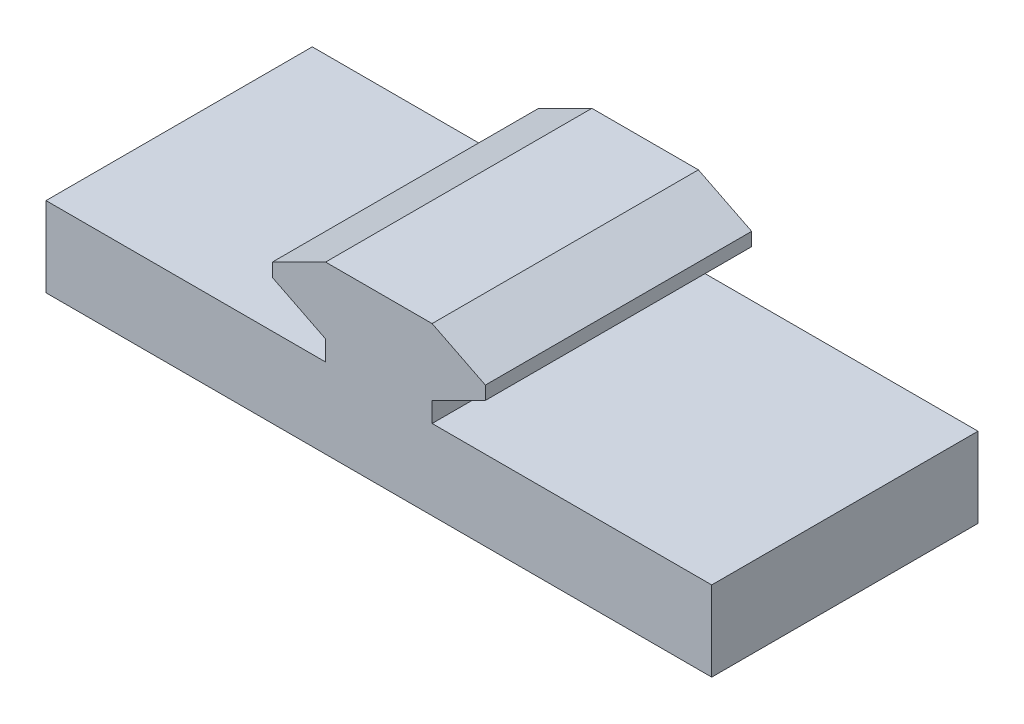
ISO-10303-21;
HEADER;
FILE_DESCRIPTION(('STEP AP214'),'2;1');
FILE_NAME('part.step','',(''),(''),'','','');
FILE_SCHEMA(('AUTOMOTIVE_DESIGN { 1 0 10303 214 1 1 1 1 }'));
ENDSEC;
DATA;
#1=APPLICATION_CONTEXT('core data for automotive mechanical design processes');
#2=APPLICATION_PROTOCOL_DEFINITION('international standard','automotive_design',2000,#1);
#3=PRODUCT_CONTEXT('',#1,'mechanical');
#4=PRODUCT('Part','Part','',(#3));
#5=PRODUCT_RELATED_PRODUCT_CATEGORY('part','',(#4));
#6=PRODUCT_DEFINITION_FORMATION('','',#4);
#7=PRODUCT_DEFINITION_CONTEXT('part definition',#1,'design');
#8=PRODUCT_DEFINITION('design','',#6,#7);
#9=PRODUCT_DEFINITION_SHAPE('','',#8);
#10=(LENGTH_UNIT() NAMED_UNIT(*) SI_UNIT(.MILLI.,.METRE.));
#11=(NAMED_UNIT(*) PLANE_ANGLE_UNIT() SI_UNIT($,.RADIAN.));
#12=(NAMED_UNIT(*) SI_UNIT($,.STERADIAN.) SOLID_ANGLE_UNIT());
#13=UNCERTAINTY_MEASURE_WITH_UNIT(LENGTH_MEASURE(1.E-05),#10,'distance_accuracy_value','');
#14=(GEOMETRIC_REPRESENTATION_CONTEXT(3) GLOBAL_UNCERTAINTY_ASSIGNED_CONTEXT((#13)) GLOBAL_UNIT_ASSIGNED_CONTEXT((#10,
#11,#12)) REPRESENTATION_CONTEXT('',''));
#15=CARTESIAN_POINT('',(0.,0.,0.));
#16=DIRECTION('',(0.,0.,1.));
#17=DIRECTION('',(1.,0.,0.));
#18=AXIS2_PLACEMENT_3D('',#15,#16,#17);
#19=CARTESIAN_POINT('',(-9.84530456711568,-8.19293028434811,20.));
#20=DIRECTION('',(1.,0.,0.));
#21=DIRECTION('',(0.,0.,-1.));
#22=AXIS2_PLACEMENT_3D('',#19,#20,#21);
#23=PLANE('',#22);
#24=DIRECTION('',(0.,-1.,0.));
#25=VECTOR('',#24,1.);
#26=CARTESIAN_POINT('',(-9.84530456711568,-8.19293028434811,0.));
#27=LINE('',#26,#25);
#28=CARTESIAN_POINT('',(-9.84530456711568,-2.19293028434811,0.));
#29=VERTEX_POINT('',#28);
#30=CARTESIAN_POINT('',(-9.84530456711568,-8.19293028434811,0.));
#31=VERTEX_POINT('',#30);
#32=EDGE_CURVE('E165',#29,#31,#27,.T.);
#33=ORIENTED_EDGE('',*,*,#32,.T.);
#34=DIRECTION('',(0.,0.,-1.));
#35=VECTOR('',#34,1.);
#36=CARTESIAN_POINT('',(-9.84530456711568,-8.19293028434811,20.));
#37=LINE('',#36,#35);
#38=CARTESIAN_POINT('',(-9.84530456711568,-8.19293028434811,20.));
#39=VERTEX_POINT('',#38);
#40=EDGE_CURVE('E11',#39,#31,#37,.T.);
#41=ORIENTED_EDGE('',*,*,#40,.F.);
#42=DIRECTION('',(0.,-1.,0.));
#43=VECTOR('',#42,1.);
#44=CARTESIAN_POINT('',(-9.84530456711568,-8.19293028434811,20.));
#45=LINE('',#44,#43);
#46=CARTESIAN_POINT('',(-9.84530456711568,-2.19293028434811,20.));
#47=VERTEX_POINT('',#46);
#48=EDGE_CURVE('E191',#47,#39,#45,.T.);
#49=ORIENTED_EDGE('',*,*,#48,.F.);
#50=DIRECTION('',(0.,0.,-1.));
#51=VECTOR('',#50,1.);
#52=CARTESIAN_POINT('',(-9.84530456711568,-2.19293028434811,20.));
#53=LINE('',#52,#51);
#54=EDGE_CURVE('E161',#47,#29,#53,.T.);
#55=ORIENTED_EDGE('',*,*,#54,.T.);
#56=EDGE_LOOP('',(#33,#41,#49,#55));
#57=FACE_BOUND('',#56,.T.);
#58=ADVANCED_FACE('F33',(#57),#23,.F.);
#59=CARTESIAN_POINT('',(-9.84530456711568,-8.19293028434811,20.));
#60=DIRECTION('',(0.,1.,0.));
#61=DIRECTION('',(0.,0.,1.));
#62=AXIS2_PLACEMENT_3D('',#59,#60,#61);
#63=PLANE('',#62);
#64=DIRECTION('',(1.,0.,0.));
#65=VECTOR('',#64,1.);
#66=CARTESIAN_POINT('',(-9.84530456711568,-8.19293028434811,0.));
#67=LINE('',#66,#65);
#68=CARTESIAN_POINT('',(40.1546954328843,-8.19293028434811,0.));
#69=VERTEX_POINT('',#68);
#70=EDGE_CURVE('E168',#31,#69,#67,.T.);
#71=ORIENTED_EDGE('',*,*,#70,.T.);
#72=DIRECTION('',(0.,0.,-1.));
#73=VECTOR('',#72,1.);
#74=CARTESIAN_POINT('',(40.1546954328843,-8.19293028434811,20.));
#75=LINE('',#74,#73);
#76=CARTESIAN_POINT('',(40.1546954328843,-8.19293028434811,20.));
#77=VERTEX_POINT('',#76);
#78=EDGE_CURVE('E41',#77,#69,#75,.T.);
#79=ORIENTED_EDGE('',*,*,#78,.F.);
#80=DIRECTION('',(1.,0.,0.));
#81=VECTOR('',#80,1.);
#82=CARTESIAN_POINT('',(-9.84530456711568,-8.19293028434811,20.));
#83=LINE('',#82,#81);
#84=EDGE_CURVE('E110',#39,#77,#83,.T.);
#85=ORIENTED_EDGE('',*,*,#84,.F.);
#86=ORIENTED_EDGE('',*,*,#40,.T.);
#87=EDGE_LOOP('',(#71,#79,#85,#86));
#88=FACE_BOUND('',#87,.T.);
#89=ADVANCED_FACE('F279',(#88),#63,.F.);
#90=CARTESIAN_POINT('',(40.1546954328843,-8.19293028434811,20.));
#91=DIRECTION('',(-1.,0.,0.));
#92=DIRECTION('',(0.,0.,1.));
#93=AXIS2_PLACEMENT_3D('',#90,#91,#92);
#94=PLANE('',#93);
#95=DIRECTION('',(0.,1.,0.));
#96=VECTOR('',#95,1.);
#97=CARTESIAN_POINT('',(40.1546954328843,-8.19293028434811,0.));
#98=LINE('',#97,#96);
#99=CARTESIAN_POINT('',(40.1546954328843,-2.19293028434811,0.));
#100=VERTEX_POINT('',#99);
#101=EDGE_CURVE('E170',#69,#100,#98,.T.);
#102=ORIENTED_EDGE('',*,*,#101,.T.);
#103=DIRECTION('',(0.,0.,-1.));
#104=VECTOR('',#103,1.);
#105=CARTESIAN_POINT('',(40.1546954328843,-2.19293028434811,20.));
#106=LINE('',#105,#104);
#107=CARTESIAN_POINT('',(40.1546954328843,-2.19293028434811,20.));
#108=VERTEX_POINT('',#107);
#109=EDGE_CURVE('E216',#108,#100,#106,.T.);
#110=ORIENTED_EDGE('',*,*,#109,.F.);
#111=DIRECTION('',(0.,1.,0.));
#112=VECTOR('',#111,1.);
#113=CARTESIAN_POINT('',(40.1546954328843,-8.19293028434811,20.));
#114=LINE('',#113,#112);
#115=EDGE_CURVE('E224',#77,#108,#114,.T.);
#116=ORIENTED_EDGE('',*,*,#115,.F.);
#117=ORIENTED_EDGE('',*,*,#78,.T.);
#118=EDGE_LOOP('',(#102,#110,#116,#117));
#119=FACE_BOUND('',#118,.T.);
#120=ADVANCED_FACE('F222',(#119),#94,.F.);
#121=CARTESIAN_POINT('',(19.1546954328843,-2.19293028434811,20.));
#122=DIRECTION('',(0.,-1.,0.));
#123=DIRECTION('',(0.,0.,-1.));
#124=AXIS2_PLACEMENT_3D('',#121,#122,#123);
#125=PLANE('',#124);
#126=DIRECTION('',(-1.,0.,0.));
#127=VECTOR('',#126,1.);
#128=CARTESIAN_POINT('',(19.1546954328843,-2.19293028434811,0.));
#129=LINE('',#128,#127);
#130=CARTESIAN_POINT('',(19.1546954328843,-2.19293028434811,0.));
#131=VERTEX_POINT('',#130);
#132=EDGE_CURVE('E172',#100,#131,#129,.T.);
#133=ORIENTED_EDGE('',*,*,#132,.T.);
#134=DIRECTION('',(0.,0.,-1.));
#135=VECTOR('',#134,1.);
#136=CARTESIAN_POINT('',(19.1546954328843,-2.19293028434811,20.));
#137=LINE('',#136,#135);
#138=CARTESIAN_POINT('',(19.1546954328843,-2.19293028434811,20.));
#139=VERTEX_POINT('',#138);
#140=EDGE_CURVE('E213',#139,#131,#137,.T.);
#141=ORIENTED_EDGE('',*,*,#140,.F.);
#142=DIRECTION('',(-1.,0.,0.));
#143=VECTOR('',#142,1.);
#144=CARTESIAN_POINT('',(19.1546954328843,-2.19293028434811,20.));
#145=LINE('',#144,#143);
#146=EDGE_CURVE('E242',#108,#139,#145,.T.);
#147=ORIENTED_EDGE('',*,*,#146,.F.);
#148=ORIENTED_EDGE('',*,*,#109,.T.);
#149=EDGE_LOOP('',(#133,#141,#147,#148));
#150=FACE_BOUND('',#149,.T.);
#151=ADVANCED_FACE('F233',(#150),#125,.F.);
#152=CARTESIAN_POINT('',(19.1546954328843,-2.19293028434811,20.));
#153=DIRECTION('',(-1.,0.,0.));
#154=DIRECTION('',(0.,0.,1.));
#155=AXIS2_PLACEMENT_3D('',#152,#153,#154);
#156=PLANE('',#155);
#157=DIRECTION('',(0.,1.,0.));
#158=VECTOR('',#157,1.);
#159=CARTESIAN_POINT('',(19.1546954328843,-2.19293028434811,0.));
#160=LINE('',#159,#158);
#161=CARTESIAN_POINT('',(19.1546954328843,-0.692930284348111,0.));
#162=VERTEX_POINT('',#161);
#163=EDGE_CURVE('E174',#131,#162,#160,.T.);
#164=ORIENTED_EDGE('',*,*,#163,.T.);
#165=DIRECTION('',(0.,0.,-1.));
#166=VECTOR('',#165,1.);
#167=CARTESIAN_POINT('',(19.1546954328843,-0.692930284348111,20.));
#168=LINE('',#167,#166);
#169=CARTESIAN_POINT('',(19.1546954328843,-0.692930284348111,20.));
#170=VERTEX_POINT('',#169);
#171=EDGE_CURVE('E210',#170,#162,#168,.T.);
#172=ORIENTED_EDGE('',*,*,#171,.F.);
#173=DIRECTION('',(0.,1.,0.));
#174=VECTOR('',#173,1.);
#175=CARTESIAN_POINT('',(19.1546954328843,-2.19293028434811,20.));
#176=LINE('',#175,#174);
#177=EDGE_CURVE('E239',#139,#170,#176,.T.);
#178=ORIENTED_EDGE('',*,*,#177,.F.);
#179=ORIENTED_EDGE('',*,*,#140,.T.);
#180=EDGE_LOOP('',(#164,#172,#178,#179));
#181=FACE_BOUND('',#180,.T.);
#182=ADVANCED_FACE('F237',(#181),#156,.F.);
#183=CARTESIAN_POINT('',(19.1546954328843,-0.692930284348111,20.));
#184=DIRECTION('',(-0.447213595499958,0.894427190999916,0.));
#185=DIRECTION('',(-0.894427190999916,-0.447213595499958,0.));
#186=AXIS2_PLACEMENT_3D('',#183,#184,#185);
#187=PLANE('',#186);
#188=DIRECTION('',(0.894427190999916,0.447213595499958,0.));
#189=VECTOR('',#188,1.);
#190=CARTESIAN_POINT('',(19.1546954328843,-0.692930284348111,0.));
#191=LINE('',#190,#189);
#192=CARTESIAN_POINT('',(23.1546954328843,1.30706971565189,0.));
#193=VERTEX_POINT('',#192);
#194=EDGE_CURVE('E176',#162,#193,#191,.T.);
#195=ORIENTED_EDGE('',*,*,#194,.T.);
#196=DIRECTION('',(0.,0.,-1.));
#197=VECTOR('',#196,1.);
#198=CARTESIAN_POINT('',(23.1546954328843,1.30706971565189,20.));
#199=LINE('',#198,#197);
#200=CARTESIAN_POINT('',(23.1546954328843,1.30706971565189,20.));
#201=VERTEX_POINT('',#200);
#202=EDGE_CURVE('E207',#201,#193,#199,.T.);
#203=ORIENTED_EDGE('',*,*,#202,.F.);
#204=DIRECTION('',(0.894427190999916,0.447213595499958,0.));
#205=VECTOR('',#204,1.);
#206=CARTESIAN_POINT('',(19.1546954328843,-0.692930284348111,20.));
#207=LINE('',#206,#205);
#208=EDGE_CURVE('E241',#170,#201,#207,.T.);
#209=ORIENTED_EDGE('',*,*,#208,.F.);
#210=ORIENTED_EDGE('',*,*,#171,.T.);
#211=EDGE_LOOP('',(#195,#203,#209,#210));
#212=FACE_BOUND('',#211,.T.);
#213=ADVANCED_FACE('F292',(#212),#187,.F.);
#214=CARTESIAN_POINT('',(23.1546954328843,1.30706971565189,20.));
#215=DIRECTION('',(-1.,0.,0.));
#216=DIRECTION('',(0.,0.,1.));
#217=AXIS2_PLACEMENT_3D('',#214,#215,#216);
#218=PLANE('',#217);
#219=DIRECTION('',(0.,1.,0.));
#220=VECTOR('',#219,1.);
#221=CARTESIAN_POINT('',(23.1546954328843,1.30706971565189,0.));
#222=LINE('',#221,#220);
#223=CARTESIAN_POINT('',(23.1546954328843,2.30706971565189,0.));
#224=VERTEX_POINT('',#223);
#225=EDGE_CURVE('E178',#193,#224,#222,.T.);
#226=ORIENTED_EDGE('',*,*,#225,.T.);
#227=DIRECTION('',(0.,0.,-1.));
#228=VECTOR('',#227,1.);
#229=CARTESIAN_POINT('',(23.1546954328843,2.30706971565189,20.));
#230=LINE('',#229,#228);
#231=CARTESIAN_POINT('',(23.1546954328843,2.30706971565189,20.));
#232=VERTEX_POINT('',#231);
#233=EDGE_CURVE('E204',#232,#224,#230,.T.);
#234=ORIENTED_EDGE('',*,*,#233,.F.);
#235=DIRECTION('',(0.,1.,0.));
#236=VECTOR('',#235,1.);
#237=CARTESIAN_POINT('',(23.1546954328843,1.30706971565189,20.));
#238=LINE('',#237,#236);
#239=EDGE_CURVE('E244',#201,#232,#238,.T.);
#240=ORIENTED_EDGE('',*,*,#239,.F.);
#241=ORIENTED_EDGE('',*,*,#202,.T.);
#242=EDGE_LOOP('',(#226,#234,#240,#241));
#243=FACE_BOUND('',#242,.T.);
#244=ADVANCED_FACE('F295',(#243),#218,.F.);
#245=CARTESIAN_POINT('',(23.1546954328843,2.30706971565189,20.));
#246=DIRECTION('',(-0.44721359549996,-0.894427190999915,0.));
#247=DIRECTION('',(0.894427190999915,-0.44721359549996,0.));
#248=AXIS2_PLACEMENT_3D('',#245,#246,#247);
#249=PLANE('',#248);
#250=DIRECTION('',(-0.894427190999915,0.44721359549996,0.));
#251=VECTOR('',#250,1.);
#252=CARTESIAN_POINT('',(23.1546954328843,2.30706971565189,0.));
#253=LINE('',#252,#251);
#254=CARTESIAN_POINT('',(19.1546954328843,4.3070697156519,0.));
#255=VERTEX_POINT('',#254);
#256=EDGE_CURVE('E180',#224,#255,#253,.T.);
#257=ORIENTED_EDGE('',*,*,#256,.T.);
#258=DIRECTION('',(0.,0.,-1.));
#259=VECTOR('',#258,1.);
#260=CARTESIAN_POINT('',(19.1546954328843,4.3070697156519,20.));
#261=LINE('',#260,#259);
#262=CARTESIAN_POINT('',(19.1546954328843,4.3070697156519,20.));
#263=VERTEX_POINT('',#262);
#264=EDGE_CURVE('E201',#263,#255,#261,.T.);
#265=ORIENTED_EDGE('',*,*,#264,.F.);
#266=DIRECTION('',(-0.894427190999915,0.44721359549996,0.));
#267=VECTOR('',#266,1.);
#268=CARTESIAN_POINT('',(23.1546954328843,2.30706971565189,20.));
#269=LINE('',#268,#267);
#270=EDGE_CURVE('E250',#232,#263,#269,.T.);
#271=ORIENTED_EDGE('',*,*,#270,.F.);
#272=ORIENTED_EDGE('',*,*,#233,.T.);
#273=EDGE_LOOP('',(#257,#265,#271,#272));
#274=FACE_BOUND('',#273,.T.);
#275=ADVANCED_FACE('F299',(#274),#249,.F.);
#276=CARTESIAN_POINT('',(11.1546954328843,4.3070697156519,20.));
#277=DIRECTION('',(0.,-1.,0.));
#278=DIRECTION('',(0.,0.,-1.));
#279=AXIS2_PLACEMENT_3D('',#276,#277,#278);
#280=PLANE('',#279);
#281=DIRECTION('',(-1.,0.,0.));
#282=VECTOR('',#281,1.);
#283=CARTESIAN_POINT('',(11.1546954328843,4.3070697156519,0.));
#284=LINE('',#283,#282);
#285=CARTESIAN_POINT('',(11.1546954328843,4.3070697156519,0.));
#286=VERTEX_POINT('',#285);
#287=EDGE_CURVE('E182',#255,#286,#284,.T.);
#288=ORIENTED_EDGE('',*,*,#287,.T.);
#289=DIRECTION('',(0.,0.,-1.));
#290=VECTOR('',#289,1.);
#291=CARTESIAN_POINT('',(11.1546954328843,4.3070697156519,20.));
#292=LINE('',#291,#290);
#293=CARTESIAN_POINT('',(11.1546954328843,4.3070697156519,20.));
#294=VERTEX_POINT('',#293);
#295=EDGE_CURVE('E198',#294,#286,#292,.T.);
#296=ORIENTED_EDGE('',*,*,#295,.F.);
#297=DIRECTION('',(-1.,0.,0.));
#298=VECTOR('',#297,1.);
#299=CARTESIAN_POINT('',(11.1546954328843,4.3070697156519,20.));
#300=LINE('',#299,#298);
#301=EDGE_CURVE('E252',#263,#294,#300,.T.);
#302=ORIENTED_EDGE('',*,*,#301,.F.);
#303=ORIENTED_EDGE('',*,*,#264,.T.);
#304=EDGE_LOOP('',(#288,#296,#302,#303));
#305=FACE_BOUND('',#304,.T.);
#306=ADVANCED_FACE('F303',(#305),#280,.F.);
#307=CARTESIAN_POINT('',(7.15469543288432,2.30706971565189,20.));
#308=DIRECTION('',(0.44721359549996,-0.894427190999915,0.));
#309=DIRECTION('',(0.894427190999915,0.44721359549996,0.));
#310=AXIS2_PLACEMENT_3D('',#307,#308,#309);
#311=PLANE('',#310);
#312=DIRECTION('',(-0.894427190999915,-0.44721359549996,0.));
#313=VECTOR('',#312,1.);
#314=CARTESIAN_POINT('',(7.15469543288432,2.30706971565189,0.));
#315=LINE('',#314,#313);
#316=CARTESIAN_POINT('',(7.15469543288432,2.30706971565189,0.));
#317=VERTEX_POINT('',#316);
#318=EDGE_CURVE('E184',#286,#317,#315,.T.);
#319=ORIENTED_EDGE('',*,*,#318,.T.);
#320=DIRECTION('',(0.,0.,-1.));
#321=VECTOR('',#320,1.);
#322=CARTESIAN_POINT('',(7.15469543288432,2.30706971565189,20.));
#323=LINE('',#322,#321);
#324=CARTESIAN_POINT('',(7.15469543288432,2.30706971565189,20.));
#325=VERTEX_POINT('',#324);
#326=EDGE_CURVE('E195',#325,#317,#323,.T.);
#327=ORIENTED_EDGE('',*,*,#326,.F.);
#328=DIRECTION('',(-0.894427190999915,-0.44721359549996,0.));
#329=VECTOR('',#328,1.);
#330=CARTESIAN_POINT('',(7.15469543288432,2.30706971565189,20.));
#331=LINE('',#330,#329);
#332=EDGE_CURVE('E254',#294,#325,#331,.T.);
#333=ORIENTED_EDGE('',*,*,#332,.F.);
#334=ORIENTED_EDGE('',*,*,#295,.T.);
#335=EDGE_LOOP('',(#319,#327,#333,#334));
#336=FACE_BOUND('',#335,.T.);
#337=ADVANCED_FACE('F260',(#336),#311,.F.);
#338=CARTESIAN_POINT('',(7.15469543288432,1.30706971565189,20.));
#339=DIRECTION('',(1.,0.,0.));
#340=DIRECTION('',(0.,0.,-1.));
#341=AXIS2_PLACEMENT_3D('',#338,#339,#340);
#342=PLANE('',#341);
#343=DIRECTION('',(0.,-1.,0.));
#344=VECTOR('',#343,1.);
#345=CARTESIAN_POINT('',(7.15469543288432,1.30706971565189,0.));
#346=LINE('',#345,#344);
#347=CARTESIAN_POINT('',(7.15469543288432,1.30706971565189,0.));
#348=VERTEX_POINT('',#347);
#349=EDGE_CURVE('E186',#317,#348,#346,.T.);
#350=ORIENTED_EDGE('',*,*,#349,.T.);
#351=DIRECTION('',(0.,0.,-1.));
#352=VECTOR('',#351,1.);
#353=CARTESIAN_POINT('',(7.15469543288432,1.30706971565189,20.));
#354=LINE('',#353,#352);
#355=CARTESIAN_POINT('',(7.15469543288432,1.30706971565189,20.));
#356=VERTEX_POINT('',#355);
#357=EDGE_CURVE('E156',#356,#348,#354,.T.);
#358=ORIENTED_EDGE('',*,*,#357,.F.);
#359=DIRECTION('',(0.,-1.,0.));
#360=VECTOR('',#359,1.);
#361=CARTESIAN_POINT('',(7.15469543288432,1.30706971565189,20.));
#362=LINE('',#361,#360);
#363=EDGE_CURVE('E147',#325,#356,#362,.T.);
#364=ORIENTED_EDGE('',*,*,#363,.F.);
#365=ORIENTED_EDGE('',*,*,#326,.T.);
#366=EDGE_LOOP('',(#350,#358,#364,#365));
#367=FACE_BOUND('',#366,.T.);
#368=ADVANCED_FACE('F264',(#367),#342,.F.);
#369=CARTESIAN_POINT('',(11.1546954328843,-0.692930284348111,20.));
#370=DIRECTION('',(0.447213595499958,0.894427190999916,0.));
#371=DIRECTION('',(-0.894427190999916,0.447213595499958,0.));
#372=AXIS2_PLACEMENT_3D('',#369,#370,#371);
#373=PLANE('',#372);
#374=DIRECTION('',(0.894427190999916,-0.447213595499958,0.));
#375=VECTOR('',#374,1.);
#376=CARTESIAN_POINT('',(11.1546954328843,-0.692930284348111,0.));
#377=LINE('',#376,#375);
#378=CARTESIAN_POINT('',(11.1546954328843,-0.692930284348111,0.));
#379=VERTEX_POINT('',#378);
#380=EDGE_CURVE('E155',#348,#379,#377,.T.);
#381=ORIENTED_EDGE('',*,*,#380,.T.);
#382=DIRECTION('',(0.,0.,-1.));
#383=VECTOR('',#382,1.);
#384=CARTESIAN_POINT('',(11.1546954328843,-0.692930284348111,20.));
#385=LINE('',#384,#383);
#386=CARTESIAN_POINT('',(11.1546954328843,-0.692930284348111,20.));
#387=VERTEX_POINT('',#386);
#388=EDGE_CURVE('E152',#387,#379,#385,.T.);
#389=ORIENTED_EDGE('',*,*,#388,.F.);
#390=DIRECTION('',(0.894427190999916,-0.447213595499958,0.));
#391=VECTOR('',#390,1.);
#392=CARTESIAN_POINT('',(11.1546954328843,-0.692930284348111,20.));
#393=LINE('',#392,#391);
#394=EDGE_CURVE('E141',#356,#387,#393,.T.);
#395=ORIENTED_EDGE('',*,*,#394,.F.);
#396=ORIENTED_EDGE('',*,*,#357,.T.);
#397=EDGE_LOOP('',(#381,#389,#395,#396));
#398=FACE_BOUND('',#397,.T.);
#399=ADVANCED_FACE('F153',(#398),#373,.F.);
#400=CARTESIAN_POINT('',(11.1546954328843,-2.19293028434811,20.));
#401=DIRECTION('',(1.,0.,0.));
#402=DIRECTION('',(0.,0.,-1.));
#403=AXIS2_PLACEMENT_3D('',#400,#401,#402);
#404=PLANE('',#403);
#405=DIRECTION('',(0.,-1.,0.));
#406=VECTOR('',#405,1.);
#407=CARTESIAN_POINT('',(11.1546954328843,-2.19293028434811,0.));
#408=LINE('',#407,#406);
#409=CARTESIAN_POINT('',(11.1546954328843,-2.19293028434811,0.));
#410=VERTEX_POINT('',#409);
#411=EDGE_CURVE('E96',#379,#410,#408,.T.);
#412=ORIENTED_EDGE('',*,*,#411,.T.);
#413=DIRECTION('',(0.,0.,-1.));
#414=VECTOR('',#413,1.);
#415=CARTESIAN_POINT('',(11.1546954328843,-2.19293028434811,20.));
#416=LINE('',#415,#414);
#417=CARTESIAN_POINT('',(11.1546954328843,-2.19293028434811,20.));
#418=VERTEX_POINT('',#417);
#419=EDGE_CURVE('E157',#418,#410,#416,.T.);
#420=ORIENTED_EDGE('',*,*,#419,.F.);
#421=DIRECTION('',(0.,-1.,0.));
#422=VECTOR('',#421,1.);
#423=CARTESIAN_POINT('',(11.1546954328843,-2.19293028434811,20.));
#424=LINE('',#423,#422);
#425=EDGE_CURVE('E145',#387,#418,#424,.T.);
#426=ORIENTED_EDGE('',*,*,#425,.F.);
#427=ORIENTED_EDGE('',*,*,#388,.T.);
#428=EDGE_LOOP('',(#412,#420,#426,#427));
#429=FACE_BOUND('',#428,.T.);
#430=ADVANCED_FACE('F159',(#429),#404,.F.);
#431=CARTESIAN_POINT('',(-9.84530456711568,-2.19293028434811,20.));
#432=DIRECTION('',(0.,-1.,0.));
#433=DIRECTION('',(0.,0.,-1.));
#434=AXIS2_PLACEMENT_3D('',#431,#432,#433);
#435=PLANE('',#434);
#436=DIRECTION('',(-1.,0.,0.));
#437=VECTOR('',#436,1.);
#438=CARTESIAN_POINT('',(-9.84530456711568,-2.19293028434811,0.));
#439=LINE('',#438,#437);
#440=EDGE_CURVE('E102',#410,#29,#439,.T.);
#441=ORIENTED_EDGE('',*,*,#440,.T.);
#442=ORIENTED_EDGE('',*,*,#54,.F.);
#443=DIRECTION('',(-1.,0.,0.));
#444=VECTOR('',#443,1.);
#445=CARTESIAN_POINT('',(-9.84530456711568,-2.19293028434811,20.));
#446=LINE('',#445,#444);
#447=EDGE_CURVE('E49',#418,#47,#446,.T.);
#448=ORIENTED_EDGE('',*,*,#447,.F.);
#449=ORIENTED_EDGE('',*,*,#419,.T.);
#450=EDGE_LOOP('',(#441,#442,#448,#449));
#451=FACE_BOUND('',#450,.T.);
#452=ADVANCED_FACE('F268',(#451),#435,.F.);
#453=CARTESIAN_POINT('',(0.,0.,20.));
#454=DIRECTION('',(0.,0.,-1.));
#455=DIRECTION('',(-1.,0.,0.));
#456=AXIS2_PLACEMENT_3D('',#453,#454,#455);
#457=PLANE('',#456);
#458=ORIENTED_EDGE('',*,*,#48,.T.);
#459=ORIENTED_EDGE('',*,*,#84,.T.);
#460=ORIENTED_EDGE('',*,*,#115,.T.);
#461=ORIENTED_EDGE('',*,*,#146,.T.);
#462=ORIENTED_EDGE('',*,*,#177,.T.);
#463=ORIENTED_EDGE('',*,*,#208,.T.);
#464=ORIENTED_EDGE('',*,*,#239,.T.);
#465=ORIENTED_EDGE('',*,*,#270,.T.);
#466=ORIENTED_EDGE('',*,*,#301,.T.);
#467=ORIENTED_EDGE('',*,*,#332,.T.);
#468=ORIENTED_EDGE('',*,*,#363,.T.);
#469=ORIENTED_EDGE('',*,*,#394,.T.);
#470=ORIENTED_EDGE('',*,*,#425,.T.);
#471=ORIENTED_EDGE('',*,*,#447,.T.);
#472=EDGE_LOOP('',(#458,#459,#460,#461,#462,#463,#464,#465,#466,#467,#468,#469,#470,#471));
#473=FACE_BOUND('',#472,.T.);
#474=ADVANCED_FACE('F143',(#473),#457,.F.);
#475=CARTESIAN_POINT('',(0.,0.,0.));
#476=DIRECTION('',(0.,0.,-1.));
#477=DIRECTION('',(-1.,0.,0.));
#478=AXIS2_PLACEMENT_3D('',#475,#476,#477);
#479=PLANE('',#478);
#480=ORIENTED_EDGE('',*,*,#32,.F.);
#481=ORIENTED_EDGE('',*,*,#440,.F.);
#482=ORIENTED_EDGE('',*,*,#411,.F.);
#483=ORIENTED_EDGE('',*,*,#380,.F.);
#484=ORIENTED_EDGE('',*,*,#349,.F.);
#485=ORIENTED_EDGE('',*,*,#318,.F.);
#486=ORIENTED_EDGE('',*,*,#287,.F.);
#487=ORIENTED_EDGE('',*,*,#256,.F.);
#488=ORIENTED_EDGE('',*,*,#225,.F.);
#489=ORIENTED_EDGE('',*,*,#194,.F.);
#490=ORIENTED_EDGE('',*,*,#163,.F.);
#491=ORIENTED_EDGE('',*,*,#132,.F.);
#492=ORIENTED_EDGE('',*,*,#101,.F.);
#493=ORIENTED_EDGE('',*,*,#70,.F.);
#494=EDGE_LOOP('',(#480,#481,#482,#483,#484,#485,#486,#487,#488,#489,#490,#491,#492,#493));
#495=FACE_BOUND('',#494,.T.);
#496=ADVANCED_FACE('F228',(#495),#479,.T.);
#497=CLOSED_SHELL('',(#58,#89,#120,#151,#182,#213,#244,#275,#306,#337,#368,#399,#430,#452,#474,#496));
#498=MANIFOLD_SOLID_BREP('B2',#497);
#499=ADVANCED_BREP_SHAPE_REPRESENTATION('',(#18,#498),#14);
#500=SHAPE_DEFINITION_REPRESENTATION(#9,#499);
ENDSEC;
END-ISO-10303-21;
